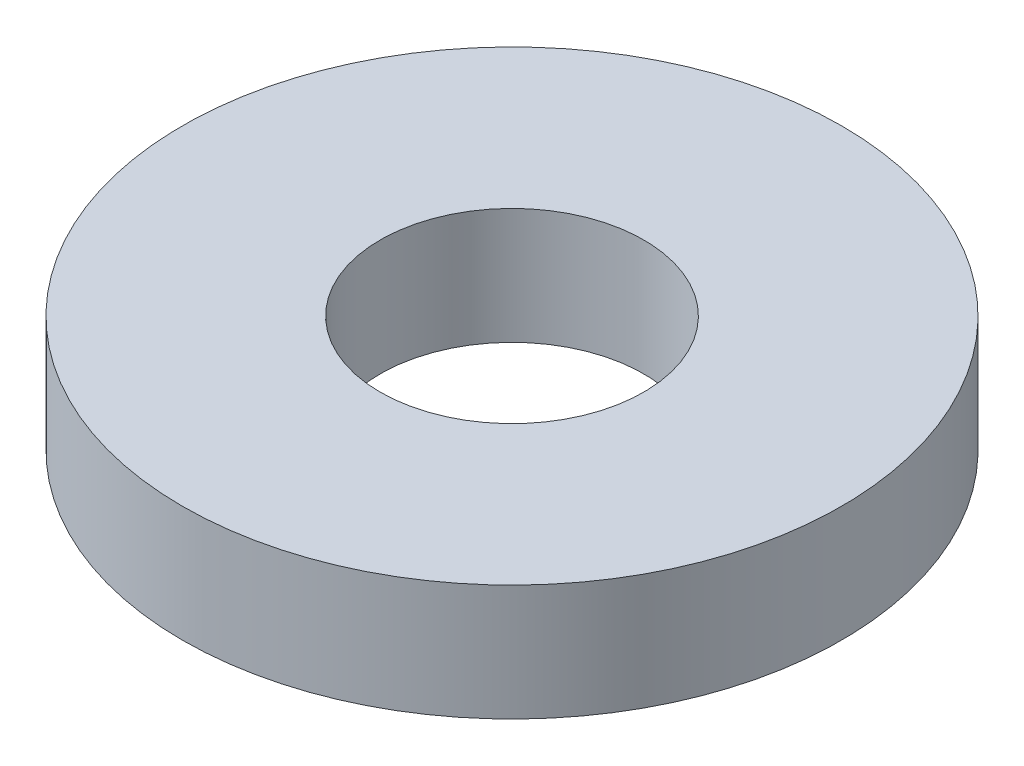
ISO-10303-21;
HEADER;
FILE_DESCRIPTION(('STEP AP214'),'2;1');
FILE_NAME('part.step','',(''),(''),'','','');
FILE_SCHEMA(('AUTOMOTIVE_DESIGN { 1 0 10303 214 1 1 1 1 }'));
ENDSEC;
DATA;
#1=APPLICATION_CONTEXT('core data for automotive mechanical design processes');
#2=APPLICATION_PROTOCOL_DEFINITION('international standard','automotive_design',2000,#1);
#3=PRODUCT_CONTEXT('',#1,'mechanical');
#4=PRODUCT('Part','Part','',(#3));
#5=PRODUCT_RELATED_PRODUCT_CATEGORY('part','',(#4));
#6=PRODUCT_DEFINITION_FORMATION('','',#4);
#7=PRODUCT_DEFINITION_CONTEXT('part definition',#1,'design');
#8=PRODUCT_DEFINITION('design','',#6,#7);
#9=PRODUCT_DEFINITION_SHAPE('','',#8);
#10=(LENGTH_UNIT() NAMED_UNIT(*) SI_UNIT(.MILLI.,.METRE.));
#11=(NAMED_UNIT(*) PLANE_ANGLE_UNIT() SI_UNIT($,.RADIAN.));
#12=(NAMED_UNIT(*) SI_UNIT($,.STERADIAN.) SOLID_ANGLE_UNIT());
#13=UNCERTAINTY_MEASURE_WITH_UNIT(LENGTH_MEASURE(1.E-05),#10,'distance_accuracy_value','');
#14=(GEOMETRIC_REPRESENTATION_CONTEXT(3) GLOBAL_UNCERTAINTY_ASSIGNED_CONTEXT((#13)) GLOBAL_UNIT_ASSIGNED_CONTEXT((#10,
#11,#12)) REPRESENTATION_CONTEXT('',''));
#15=CARTESIAN_POINT('',(0.,0.,0.));
#16=DIRECTION('',(0.,0.,1.));
#17=DIRECTION('',(1.,0.,0.));
#18=AXIS2_PLACEMENT_3D('',#15,#16,#17);
#19=CARTESIAN_POINT('',(0.,22.,0.));
#20=DIRECTION('',(0.,-1.,0.));
#21=DIRECTION('',(0.,0.,-1.));
#22=AXIS2_PLACEMENT_3D('',#19,#20,#21);
#23=CYLINDRICAL_SURFACE('',#22,62.5);
#24=CARTESIAN_POINT('',(0.,22.,0.));
#25=DIRECTION('',(0.,1.,0.));
#26=DIRECTION('',(0.,0.,1.));
#27=AXIS2_PLACEMENT_3D('',#24,#25,#26);
#28=CIRCLE('',#27,62.5);
#29=CARTESIAN_POINT('',(0.,22.,62.5));
#30=VERTEX_POINT('',#29);
#31=EDGE_CURVE('E10',#30,#30,#28,.T.);
#32=ORIENTED_EDGE('',*,*,#31,.F.);
#33=EDGE_LOOP('',(#32));
#34=FACE_BOUND('',#33,.T.);
#35=CARTESIAN_POINT('',(0.,0.,0.));
#36=DIRECTION('',(0.,1.,0.));
#37=DIRECTION('',(0.,0.,1.));
#38=AXIS2_PLACEMENT_3D('',#35,#36,#37);
#39=CIRCLE('',#38,62.5);
#40=CARTESIAN_POINT('',(0.,0.,62.5));
#41=VERTEX_POINT('',#40);
#42=EDGE_CURVE('E37',#41,#41,#39,.T.);
#43=ORIENTED_EDGE('',*,*,#42,.T.);
#44=EDGE_LOOP('',(#43));
#45=FACE_BOUND('',#44,.T.);
#46=ADVANCED_FACE('F40',(#34,#45),#23,.T.);
#47=CARTESIAN_POINT('',(0.,22.,0.));
#48=DIRECTION('',(0.,1.,0.));
#49=DIRECTION('',(0.,0.,1.));
#50=AXIS2_PLACEMENT_3D('',#47,#48,#49);
#51=PLANE('',#50);
#52=CARTESIAN_POINT('',(0.,22.,0.));
#53=DIRECTION('',(0.,1.,0.));
#54=DIRECTION('',(0.,0.,1.));
#55=AXIS2_PLACEMENT_3D('',#52,#53,#54);
#56=CIRCLE('',#55,25.);
#57=CARTESIAN_POINT('',(0.,22.,25.));
#58=VERTEX_POINT('',#57);
#59=EDGE_CURVE('E50',#58,#58,#56,.T.);
#60=ORIENTED_EDGE('',*,*,#59,.F.);
#61=EDGE_LOOP('',(#60));
#62=FACE_BOUND('',#61,.T.);
#63=ORIENTED_EDGE('',*,*,#31,.T.);
#64=EDGE_LOOP('',(#63));
#65=FACE_BOUND('',#64,.T.);
#66=ADVANCED_FACE('F59',(#62,#65),#51,.T.);
#67=CARTESIAN_POINT('',(0.,0.,0.));
#68=DIRECTION('',(0.,1.,0.));
#69=DIRECTION('',(0.,0.,1.));
#70=AXIS2_PLACEMENT_3D('',#67,#68,#69);
#71=PLANE('',#70);
#72=CARTESIAN_POINT('',(0.,0.,0.));
#73=DIRECTION('',(0.,1.,0.));
#74=DIRECTION('',(0.,0.,1.));
#75=AXIS2_PLACEMENT_3D('',#72,#73,#74);
#76=CIRCLE('',#75,25.);
#77=CARTESIAN_POINT('',(0.,0.,25.));
#78=VERTEX_POINT('',#77);
#79=EDGE_CURVE('E47',#78,#78,#76,.T.);
#80=ORIENTED_EDGE('',*,*,#79,.T.);
#81=EDGE_LOOP('',(#80));
#82=FACE_BOUND('',#81,.T.);
#83=ORIENTED_EDGE('',*,*,#42,.F.);
#84=EDGE_LOOP('',(#83));
#85=FACE_BOUND('',#84,.T.);
#86=ADVANCED_FACE('F58',(#82,#85),#71,.F.);
#87=CARTESIAN_POINT('',(0.,22.,0.));
#88=DIRECTION('',(0.,-1.,0.));
#89=DIRECTION('',(0.,0.,-1.));
#90=AXIS2_PLACEMENT_3D('',#87,#88,#89);
#91=CYLINDRICAL_SURFACE('',#90,25.);
#92=ORIENTED_EDGE('',*,*,#59,.T.);
#93=EDGE_LOOP('',(#92));
#94=FACE_BOUND('',#93,.T.);
#95=ORIENTED_EDGE('',*,*,#79,.F.);
#96=EDGE_LOOP('',(#95));
#97=FACE_BOUND('',#96,.T.);
#98=ADVANCED_FACE('F54',(#94,#97),#91,.F.);
#99=CLOSED_SHELL('',(#46,#66,#86,#98));
#100=MANIFOLD_SOLID_BREP('B2',#99);
#101=ADVANCED_BREP_SHAPE_REPRESENTATION('',(#18,#100),#14);
#102=SHAPE_DEFINITION_REPRESENTATION(#9,#101);
ENDSEC;
END-ISO-10303-21;
